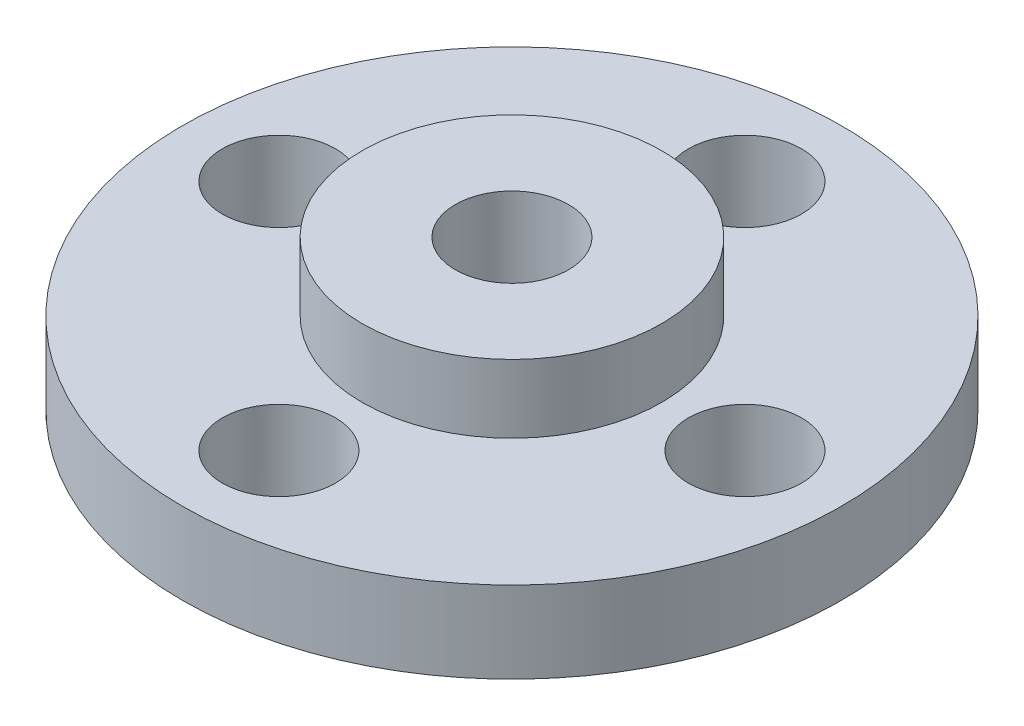
ISO-10303-21;
HEADER;
FILE_DESCRIPTION(('STEP AP214'),'2;1');
FILE_NAME('part.step','',(''),(''),'','','');
FILE_SCHEMA(('AUTOMOTIVE_DESIGN { 1 0 10303 214 1 1 1 1 }'));
ENDSEC;
DATA;
#1=APPLICATION_CONTEXT('core data for automotive mechanical design processes');
#2=APPLICATION_PROTOCOL_DEFINITION('international standard','automotive_design',2000,#1);
#3=PRODUCT_CONTEXT('',#1,'mechanical');
#4=PRODUCT('Part','Part','',(#3));
#5=PRODUCT_RELATED_PRODUCT_CATEGORY('part','',(#4));
#6=PRODUCT_DEFINITION_FORMATION('','',#4);
#7=PRODUCT_DEFINITION_CONTEXT('part definition',#1,'design');
#8=PRODUCT_DEFINITION('design','',#6,#7);
#9=PRODUCT_DEFINITION_SHAPE('','',#8);
#10=(LENGTH_UNIT() NAMED_UNIT(*) SI_UNIT(.MILLI.,.METRE.));
#11=(NAMED_UNIT(*) PLANE_ANGLE_UNIT() SI_UNIT($,.RADIAN.));
#12=(NAMED_UNIT(*) SI_UNIT($,.STERADIAN.) SOLID_ANGLE_UNIT());
#13=UNCERTAINTY_MEASURE_WITH_UNIT(LENGTH_MEASURE(1.E-05),#10,'distance_accuracy_value','');
#14=(GEOMETRIC_REPRESENTATION_CONTEXT(3) GLOBAL_UNCERTAINTY_ASSIGNED_CONTEXT((#13)) GLOBAL_UNIT_ASSIGNED_CONTEXT((#10,
#11,#12)) REPRESENTATION_CONTEXT('',''));
#15=CARTESIAN_POINT('',(0.,0.,0.));
#16=DIRECTION('',(0.,0.,1.));
#17=DIRECTION('',(1.,0.,0.));
#18=AXIS2_PLACEMENT_3D('',#15,#16,#17);
#19=CARTESIAN_POINT('',(0.,1.225,0.));
#20=DIRECTION('',(0.,-1.,0.));
#21=DIRECTION('',(0.,0.,-1.));
#22=AXIS2_PLACEMENT_3D('',#19,#20,#21);
#23=CYLINDRICAL_SURFACE('',#22,9.9);
#24=CARTESIAN_POINT('',(0.,1.225,0.));
#25=DIRECTION('',(0.,1.,0.));
#26=DIRECTION('',(0.,0.,1.));
#27=AXIS2_PLACEMENT_3D('',#24,#25,#26);
#28=CIRCLE('',#27,9.9);
#29=CARTESIAN_POINT('',(0.,1.225,9.9));
#30=VERTEX_POINT('',#29);
#31=EDGE_CURVE('E52',#30,#30,#28,.T.);
#32=ORIENTED_EDGE('',*,*,#31,.F.);
#33=EDGE_LOOP('',(#32));
#34=FACE_BOUND('',#33,.T.);
#35=CARTESIAN_POINT('',(0.,-1.225,0.));
#36=DIRECTION('',(0.,1.,0.));
#37=DIRECTION('',(0.,0.,1.));
#38=AXIS2_PLACEMENT_3D('',#35,#36,#37);
#39=CIRCLE('',#38,9.9);
#40=CARTESIAN_POINT('',(0.,-1.225,9.9));
#41=VERTEX_POINT('',#40);
#42=EDGE_CURVE('E48',#41,#41,#39,.T.);
#43=ORIENTED_EDGE('',*,*,#42,.T.);
#44=EDGE_LOOP('',(#43));
#45=FACE_BOUND('',#44,.T.);
#46=ADVANCED_FACE('F45',(#34,#45),#23,.T.);
#47=CARTESIAN_POINT('',(0.,1.225,0.));
#48=DIRECTION('',(0.,1.,0.));
#49=DIRECTION('',(0.,0.,1.));
#50=AXIS2_PLACEMENT_3D('',#47,#48,#49);
#51=PLANE('',#50);
#52=CARTESIAN_POINT('',(0.,1.225,-7.));
#53=DIRECTION('',(0.,1.,0.));
#54=DIRECTION('',(0.,0.,1.));
#55=AXIS2_PLACEMENT_3D('',#52,#53,#54);
#56=CIRCLE('',#55,1.7);
#57=CARTESIAN_POINT('',(0.,1.225,-5.3));
#58=VERTEX_POINT('',#57);
#59=EDGE_CURVE('E79',#58,#58,#56,.T.);
#60=ORIENTED_EDGE('',*,*,#59,.F.);
#61=EDGE_LOOP('',(#60));
#62=FACE_BOUND('',#61,.T.);
#63=CARTESIAN_POINT('',(-7.,1.225,0.));
#64=DIRECTION('',(0.,1.,0.));
#65=DIRECTION('',(0.,0.,1.));
#66=AXIS2_PLACEMENT_3D('',#63,#64,#65);
#67=CIRCLE('',#66,1.7);
#68=CARTESIAN_POINT('',(-7.,1.225,1.7));
#69=VERTEX_POINT('',#68);
#70=EDGE_CURVE('E73',#69,#69,#67,.T.);
#71=ORIENTED_EDGE('',*,*,#70,.F.);
#72=EDGE_LOOP('',(#71));
#73=FACE_BOUND('',#72,.T.);
#74=CARTESIAN_POINT('',(0.,1.225,7.));
#75=DIRECTION('',(0.,1.,0.));
#76=DIRECTION('',(0.,0.,1.));
#77=AXIS2_PLACEMENT_3D('',#74,#75,#76);
#78=CIRCLE('',#77,1.7);
#79=CARTESIAN_POINT('',(0.,1.225,8.7));
#80=VERTEX_POINT('',#79);
#81=EDGE_CURVE('E67',#80,#80,#78,.T.);
#82=ORIENTED_EDGE('',*,*,#81,.F.);
#83=EDGE_LOOP('',(#82));
#84=FACE_BOUND('',#83,.T.);
#85=CARTESIAN_POINT('',(7.,1.225,0.));
#86=DIRECTION('',(0.,1.,0.));
#87=DIRECTION('',(0.,0.,1.));
#88=AXIS2_PLACEMENT_3D('',#85,#86,#87);
#89=CIRCLE('',#88,1.7);
#90=CARTESIAN_POINT('',(7.,1.225,1.7));
#91=VERTEX_POINT('',#90);
#92=EDGE_CURVE('E61',#91,#91,#89,.T.);
#93=ORIENTED_EDGE('',*,*,#92,.F.);
#94=EDGE_LOOP('',(#93));
#95=FACE_BOUND('',#94,.T.);
#96=CARTESIAN_POINT('',(0.,1.225,0.));
#97=DIRECTION('',(0.,1.,0.));
#98=DIRECTION('',(0.,0.,1.));
#99=AXIS2_PLACEMENT_3D('',#96,#97,#98);
#100=CIRCLE('',#99,4.5);
#101=CARTESIAN_POINT('',(0.,1.225,4.5));
#102=VERTEX_POINT('',#101);
#103=EDGE_CURVE('E10',#102,#102,#100,.T.);
#104=ORIENTED_EDGE('',*,*,#103,.F.);
#105=EDGE_LOOP('',(#104));
#106=FACE_BOUND('',#105,.T.);
#107=ORIENTED_EDGE('',*,*,#31,.T.);
#108=EDGE_LOOP('',(#107));
#109=FACE_BOUND('',#108,.T.);
#110=ADVANCED_FACE('F98',(#62,#73,#84,#95,#106,#109),#51,.T.);
#111=CARTESIAN_POINT('',(0.,-1.225,0.));
#112=DIRECTION('',(0.,1.,0.));
#113=DIRECTION('',(0.,0.,1.));
#114=AXIS2_PLACEMENT_3D('',#111,#112,#113);
#115=PLANE('',#114);
#116=CARTESIAN_POINT('',(0.,-1.225,0.));
#117=DIRECTION('',(0.,-1.,0.));
#118=DIRECTION('',(0.,0.,-1.));
#119=AXIS2_PLACEMENT_3D('',#116,#117,#118);
#120=CIRCLE('',#119,1.7);
#121=CARTESIAN_POINT('',(0.,-1.225,-1.7));
#122=VERTEX_POINT('',#121);
#123=EDGE_CURVE('E88',#122,#122,#120,.T.);
#124=ORIENTED_EDGE('',*,*,#123,.F.);
#125=EDGE_LOOP('',(#124));
#126=FACE_BOUND('',#125,.T.);
#127=CARTESIAN_POINT('',(0.,-1.225,-7.));
#128=DIRECTION('',(0.,-1.,0.));
#129=DIRECTION('',(0.,0.,-1.));
#130=AXIS2_PLACEMENT_3D('',#127,#128,#129);
#131=CIRCLE('',#130,1.7);
#132=CARTESIAN_POINT('',(0.,-1.225,-8.7));
#133=VERTEX_POINT('',#132);
#134=EDGE_CURVE('E82',#133,#133,#131,.T.);
#135=ORIENTED_EDGE('',*,*,#134,.F.);
#136=EDGE_LOOP('',(#135));
#137=FACE_BOUND('',#136,.T.);
#138=CARTESIAN_POINT('',(-7.,-1.225,0.));
#139=DIRECTION('',(0.,-1.,0.));
#140=DIRECTION('',(0.,0.,-1.));
#141=AXIS2_PLACEMENT_3D('',#138,#139,#140);
#142=CIRCLE('',#141,1.7);
#143=CARTESIAN_POINT('',(-7.,-1.225,-1.7));
#144=VERTEX_POINT('',#143);
#145=EDGE_CURVE('E76',#144,#144,#142,.T.);
#146=ORIENTED_EDGE('',*,*,#145,.F.);
#147=EDGE_LOOP('',(#146));
#148=FACE_BOUND('',#147,.T.);
#149=CARTESIAN_POINT('',(0.,-1.225,7.));
#150=DIRECTION('',(0.,-1.,0.));
#151=DIRECTION('',(0.,0.,-1.));
#152=AXIS2_PLACEMENT_3D('',#149,#150,#151);
#153=CIRCLE('',#152,1.7);
#154=CARTESIAN_POINT('',(0.,-1.225,5.3));
#155=VERTEX_POINT('',#154);
#156=EDGE_CURVE('E70',#155,#155,#153,.T.);
#157=ORIENTED_EDGE('',*,*,#156,.F.);
#158=EDGE_LOOP('',(#157));
#159=FACE_BOUND('',#158,.T.);
#160=CARTESIAN_POINT('',(7.,-1.225,0.));
#161=DIRECTION('',(0.,-1.,0.));
#162=DIRECTION('',(0.,0.,-1.));
#163=AXIS2_PLACEMENT_3D('',#160,#161,#162);
#164=CIRCLE('',#163,1.7);
#165=CARTESIAN_POINT('',(7.,-1.225,-1.7));
#166=VERTEX_POINT('',#165);
#167=EDGE_CURVE('E64',#166,#166,#164,.T.);
#168=ORIENTED_EDGE('',*,*,#167,.F.);
#169=EDGE_LOOP('',(#168));
#170=FACE_BOUND('',#169,.T.);
#171=ORIENTED_EDGE('',*,*,#42,.F.);
#172=EDGE_LOOP('',(#171));
#173=FACE_BOUND('',#172,.T.);
#174=ADVANCED_FACE('F94',(#126,#137,#148,#159,#170,#173),#115,.F.);
#175=CARTESIAN_POINT('',(0.,3.275,0.));
#176=DIRECTION('',(0.,-1.,0.));
#177=DIRECTION('',(0.,0.,-1.));
#178=AXIS2_PLACEMENT_3D('',#175,#176,#177);
#179=CYLINDRICAL_SURFACE('',#178,4.5);
#180=CARTESIAN_POINT('',(0.,3.275,0.));
#181=DIRECTION('',(0.,1.,0.));
#182=DIRECTION('',(0.,0.,1.));
#183=AXIS2_PLACEMENT_3D('',#180,#181,#182);
#184=CIRCLE('',#183,4.5);
#185=CARTESIAN_POINT('',(0.,3.275,4.5));
#186=VERTEX_POINT('',#185);
#187=EDGE_CURVE('E58',#186,#186,#184,.T.);
#188=ORIENTED_EDGE('',*,*,#187,.F.);
#189=EDGE_LOOP('',(#188));
#190=FACE_BOUND('',#189,.T.);
#191=ORIENTED_EDGE('',*,*,#103,.T.);
#192=EDGE_LOOP('',(#191));
#193=FACE_BOUND('',#192,.T.);
#194=ADVANCED_FACE('F97',(#190,#193),#179,.T.);
#195=CARTESIAN_POINT('',(0.,3.275,0.));
#196=DIRECTION('',(0.,1.,0.));
#197=DIRECTION('',(0.,0.,1.));
#198=AXIS2_PLACEMENT_3D('',#195,#196,#197);
#199=PLANE('',#198);
#200=CARTESIAN_POINT('',(0.,3.275,0.));
#201=DIRECTION('',(0.,-1.,0.));
#202=DIRECTION('',(0.,0.,-1.));
#203=AXIS2_PLACEMENT_3D('',#200,#201,#202);
#204=CIRCLE('',#203,1.7);
#205=CARTESIAN_POINT('',(0.,3.275,-1.7));
#206=VERTEX_POINT('',#205);
#207=EDGE_CURVE('E85',#206,#206,#204,.T.);
#208=ORIENTED_EDGE('',*,*,#207,.T.);
#209=EDGE_LOOP('',(#208));
#210=FACE_BOUND('',#209,.T.);
#211=ORIENTED_EDGE('',*,*,#187,.T.);
#212=EDGE_LOOP('',(#211));
#213=FACE_BOUND('',#212,.T.);
#214=ADVANCED_FACE('F126',(#210,#213),#199,.T.);
#215=CARTESIAN_POINT('',(7.,-1.225,0.));
#216=DIRECTION('',(0.,-1.,0.));
#217=DIRECTION('',(0.,0.,-1.));
#218=AXIS2_PLACEMENT_3D('',#215,#216,#217);
#219=CYLINDRICAL_SURFACE('',#218,1.7);
#220=ORIENTED_EDGE('',*,*,#92,.T.);
#221=EDGE_LOOP('',(#220));
#222=FACE_BOUND('',#221,.T.);
#223=ORIENTED_EDGE('',*,*,#167,.T.);
#224=EDGE_LOOP('',(#223));
#225=FACE_BOUND('',#224,.T.);
#226=ADVANCED_FACE('F130',(#222,#225),#219,.F.);
#227=CARTESIAN_POINT('',(0.,-1.225,7.));
#228=DIRECTION('',(0.,-1.,0.));
#229=DIRECTION('',(0.,0.,-1.));
#230=AXIS2_PLACEMENT_3D('',#227,#228,#229);
#231=CYLINDRICAL_SURFACE('',#230,1.7);
#232=ORIENTED_EDGE('',*,*,#81,.T.);
#233=EDGE_LOOP('',(#232));
#234=FACE_BOUND('',#233,.T.);
#235=ORIENTED_EDGE('',*,*,#156,.T.);
#236=EDGE_LOOP('',(#235));
#237=FACE_BOUND('',#236,.T.);
#238=ADVANCED_FACE('F134',(#234,#237),#231,.F.);
#239=CARTESIAN_POINT('',(-7.,-1.225,0.));
#240=DIRECTION('',(0.,-1.,0.));
#241=DIRECTION('',(0.,0.,-1.));
#242=AXIS2_PLACEMENT_3D('',#239,#240,#241);
#243=CYLINDRICAL_SURFACE('',#242,1.7);
#244=ORIENTED_EDGE('',*,*,#70,.T.);
#245=EDGE_LOOP('',(#244));
#246=FACE_BOUND('',#245,.T.);
#247=ORIENTED_EDGE('',*,*,#145,.T.);
#248=EDGE_LOOP('',(#247));
#249=FACE_BOUND('',#248,.T.);
#250=ADVANCED_FACE('F138',(#246,#249),#243,.F.);
#251=CARTESIAN_POINT('',(0.,-1.225,-7.));
#252=DIRECTION('',(0.,-1.,0.));
#253=DIRECTION('',(0.,0.,-1.));
#254=AXIS2_PLACEMENT_3D('',#251,#252,#253);
#255=CYLINDRICAL_SURFACE('',#254,1.7);
#256=ORIENTED_EDGE('',*,*,#59,.T.);
#257=EDGE_LOOP('',(#256));
#258=FACE_BOUND('',#257,.T.);
#259=ORIENTED_EDGE('',*,*,#134,.T.);
#260=EDGE_LOOP('',(#259));
#261=FACE_BOUND('',#260,.T.);
#262=ADVANCED_FACE('F142',(#258,#261),#255,.F.);
#263=CARTESIAN_POINT('',(0.,-1.225,0.));
#264=DIRECTION('',(0.,-1.,0.));
#265=DIRECTION('',(0.,0.,-1.));
#266=AXIS2_PLACEMENT_3D('',#263,#264,#265);
#267=CYLINDRICAL_SURFACE('',#266,1.7);
#268=ORIENTED_EDGE('',*,*,#207,.F.);
#269=EDGE_LOOP('',(#268));
#270=FACE_BOUND('',#269,.T.);
#271=ORIENTED_EDGE('',*,*,#123,.T.);
#272=EDGE_LOOP('',(#271));
#273=FACE_BOUND('',#272,.T.);
#274=ADVANCED_FACE('F92',(#270,#273),#267,.F.);
#275=CLOSED_SHELL('',(#46,#110,#174,#194,#214,#226,#238,#250,#262,#274));
#276=MANIFOLD_SOLID_BREP('B2',#275);
#277=ADVANCED_BREP_SHAPE_REPRESENTATION('',(#18,#276),#14);
#278=SHAPE_DEFINITION_REPRESENTATION(#9,#277);
ENDSEC;
END-ISO-10303-21;
